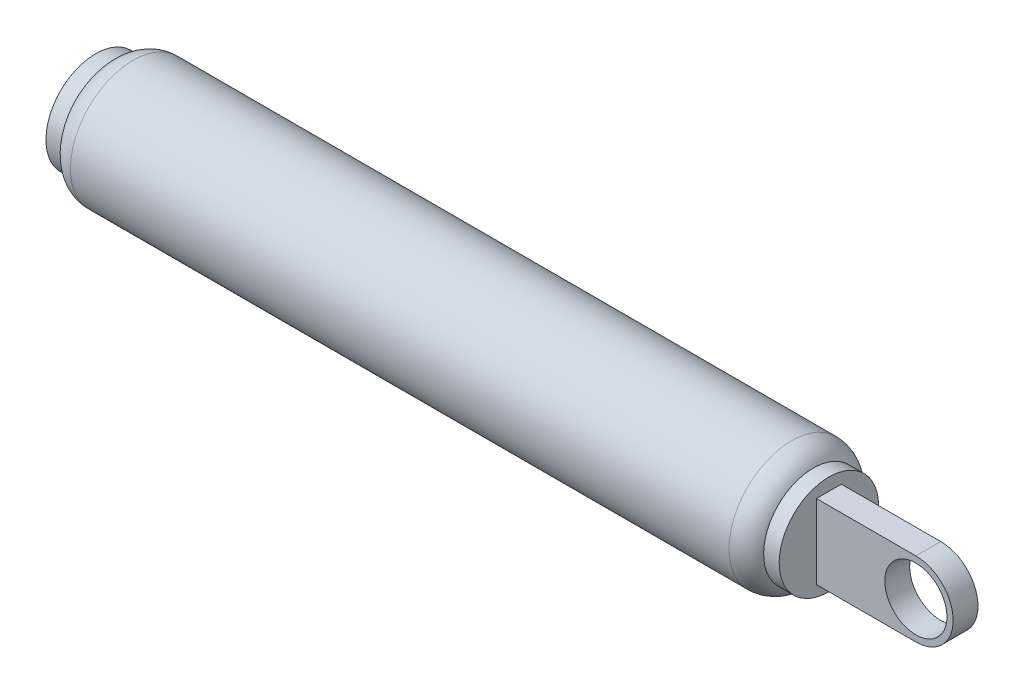
ISO-10303-21;
HEADER;
FILE_DESCRIPTION(('STEP AP214'),'2;1');
FILE_NAME('part.step','',(''),(''),'','','');
FILE_SCHEMA(('AUTOMOTIVE_DESIGN { 1 0 10303 214 1 1 1 1 }'));
ENDSEC;
DATA;
#1=APPLICATION_CONTEXT('core data for automotive mechanical design processes');
#2=APPLICATION_PROTOCOL_DEFINITION('international standard','automotive_design',2000,#1);
#3=PRODUCT_CONTEXT('',#1,'mechanical');
#4=PRODUCT('Part','Part','',(#3));
#5=PRODUCT_RELATED_PRODUCT_CATEGORY('part','',(#4));
#6=PRODUCT_DEFINITION_FORMATION('','',#4);
#7=PRODUCT_DEFINITION_CONTEXT('part definition',#1,'design');
#8=PRODUCT_DEFINITION('design','',#6,#7);
#9=PRODUCT_DEFINITION_SHAPE('','',#8);
#10=(LENGTH_UNIT() NAMED_UNIT(*) SI_UNIT(.MILLI.,.METRE.));
#11=(NAMED_UNIT(*) PLANE_ANGLE_UNIT() SI_UNIT($,.RADIAN.));
#12=(NAMED_UNIT(*) SI_UNIT($,.STERADIAN.) SOLID_ANGLE_UNIT());
#13=UNCERTAINTY_MEASURE_WITH_UNIT(LENGTH_MEASURE(1.E-05),#10,'distance_accuracy_value','');
#14=(GEOMETRIC_REPRESENTATION_CONTEXT(3) GLOBAL_UNCERTAINTY_ASSIGNED_CONTEXT((#13)) GLOBAL_UNIT_ASSIGNED_CONTEXT((#10,
#11,#12)) REPRESENTATION_CONTEXT('',''));
#15=CARTESIAN_POINT('',(0.,0.,0.));
#16=DIRECTION('',(0.,0.,1.));
#17=DIRECTION('',(1.,0.,0.));
#18=AXIS2_PLACEMENT_3D('',#15,#16,#17);
#19=CARTESIAN_POINT('',(29.5,0.,0.));
#20=DIRECTION('',(-1.,0.,0.));
#21=DIRECTION('',(0.,-1.,0.));
#22=AXIS2_PLACEMENT_3D('',#19,#20,#21);
#23=CYLINDRICAL_SURFACE('',#22,4.);
#24=CARTESIAN_POINT('',(29.5,0.,0.));
#25=DIRECTION('',(-1.,0.,0.));
#26=DIRECTION('',(0.,-1.,0.));
#27=AXIS2_PLACEMENT_3D('',#24,#25,#26);
#28=CIRCLE('',#27,4.);
#29=CARTESIAN_POINT('',(29.5,-4.,0.));
#30=VERTEX_POINT('',#29);
#31=EDGE_CURVE('E11',#30,#30,#28,.T.);
#32=ORIENTED_EDGE('',*,*,#31,.T.);
#33=EDGE_LOOP('',(#32));
#34=FACE_BOUND('',#33,.T.);
#35=CARTESIAN_POINT('',(28.25,0.,0.));
#36=DIRECTION('',(-1.,0.,0.));
#37=DIRECTION('',(0.,-1.,0.));
#38=AXIS2_PLACEMENT_3D('',#35,#36,#37);
#39=CIRCLE('',#38,4.);
#40=CARTESIAN_POINT('',(28.25,-4.,0.));
#41=VERTEX_POINT('',#40);
#42=EDGE_CURVE('E109',#41,#41,#39,.T.);
#43=ORIENTED_EDGE('',*,*,#42,.F.);
#44=EDGE_LOOP('',(#43));
#45=FACE_BOUND('',#44,.T.);
#46=ADVANCED_FACE('F39',(#34,#45),#23,.T.);
#47=CARTESIAN_POINT('',(29.5,4.,0.));
#48=DIRECTION('',(1.,0.,0.));
#49=DIRECTION('',(0.,1.,0.));
#50=AXIS2_PLACEMENT_3D('',#47,#48,#49);
#51=PLANE('',#50);
#52=DIRECTION('',(0.,-1.,0.));
#53=VECTOR('',#52,1.);
#54=CARTESIAN_POINT('',(29.5,3.,1.));
#55=LINE('',#54,#53);
#56=CARTESIAN_POINT('',(29.5,3.,1.));
#57=VERTEX_POINT('',#56);
#58=CARTESIAN_POINT('',(29.5,-3.,1.));
#59=VERTEX_POINT('',#58);
#60=EDGE_CURVE('E102',#57,#59,#55,.T.);
#61=ORIENTED_EDGE('',*,*,#60,.F.);
#62=DIRECTION('',(0.,0.,1.));
#63=VECTOR('',#62,1.);
#64=CARTESIAN_POINT('',(29.5,3.,-1.));
#65=LINE('',#64,#63);
#66=CARTESIAN_POINT('',(29.5,3.,-1.));
#67=VERTEX_POINT('',#66);
#68=EDGE_CURVE('E95',#67,#57,#65,.T.);
#69=ORIENTED_EDGE('',*,*,#68,.F.);
#70=DIRECTION('',(0.,-1.,0.));
#71=VECTOR('',#70,1.);
#72=CARTESIAN_POINT('',(29.5,3.,-1.));
#73=LINE('',#72,#71);
#74=CARTESIAN_POINT('',(29.5,-3.,-1.));
#75=VERTEX_POINT('',#74);
#76=EDGE_CURVE('E86',#67,#75,#73,.T.);
#77=ORIENTED_EDGE('',*,*,#76,.T.);
#78=DIRECTION('',(0.,0.,1.));
#79=VECTOR('',#78,1.);
#80=CARTESIAN_POINT('',(29.5,-3.,-1.));
#81=LINE('',#80,#79);
#82=EDGE_CURVE('E103',#75,#59,#81,.T.);
#83=ORIENTED_EDGE('',*,*,#82,.T.);
#84=EDGE_LOOP('',(#61,#69,#77,#83));
#85=FACE_BOUND('',#84,.T.);
#86=ORIENTED_EDGE('',*,*,#31,.F.);
#87=EDGE_LOOP('',(#86));
#88=FACE_BOUND('',#87,.T.);
#89=ADVANCED_FACE('F100',(#85,#88),#51,.T.);
#90=CARTESIAN_POINT('',(-29.5,0.,0.));
#91=DIRECTION('',(-1.,0.,0.));
#92=DIRECTION('',(0.,-1.,0.));
#93=AXIS2_PLACEMENT_3D('',#90,#91,#92);
#94=PLANE('',#93);
#95=CARTESIAN_POINT('',(-29.5,0.,0.));
#96=DIRECTION('',(-1.,0.,0.));
#97=DIRECTION('',(0.,0.,1.));
#98=AXIS2_PLACEMENT_3D('',#95,#96,#97);
#99=CIRCLE('',#98,2.99999999999999);
#100=CARTESIAN_POINT('',(-29.5,0.,2.99999999999999));
#101=VERTEX_POINT('',#100);
#102=EDGE_CURVE('E199',#101,#101,#99,.T.);
#103=ORIENTED_EDGE('',*,*,#102,.F.);
#104=EDGE_LOOP('',(#103));
#105=FACE_BOUND('',#104,.T.);
#106=CARTESIAN_POINT('',(-29.5,0.,0.));
#107=DIRECTION('',(-1.,0.,0.));
#108=DIRECTION('',(0.,-1.,0.));
#109=AXIS2_PLACEMENT_3D('',#106,#107,#108);
#110=CIRCLE('',#109,4.);
#111=CARTESIAN_POINT('',(-29.5,-3.99999999999999,0.));
#112=VERTEX_POINT('',#111);
#113=EDGE_CURVE('E46',#112,#112,#110,.T.);
#114=ORIENTED_EDGE('',*,*,#113,.T.);
#115=EDGE_LOOP('',(#114));
#116=FACE_BOUND('',#115,.T.);
#117=ADVANCED_FACE('F123',(#105,#116),#94,.T.);
#118=CARTESIAN_POINT('',(29.5,0.,0.));
#119=DIRECTION('',(-1.,0.,0.));
#120=DIRECTION('',(0.,-1.,0.));
#121=AXIS2_PLACEMENT_3D('',#118,#119,#120);
#122=CYLINDRICAL_SURFACE('',#121,4.);
#123=CARTESIAN_POINT('',(-28.25,0.,0.));
#124=DIRECTION('',(-1.,0.,0.));
#125=DIRECTION('',(0.,-1.,0.));
#126=AXIS2_PLACEMENT_3D('',#123,#124,#125);
#127=CIRCLE('',#126,4.);
#128=CARTESIAN_POINT('',(-28.25,-3.99999999999999,0.));
#129=VERTEX_POINT('',#128);
#130=EDGE_CURVE('E118',#129,#129,#127,.T.);
#131=ORIENTED_EDGE('',*,*,#130,.T.);
#132=EDGE_LOOP('',(#131));
#133=FACE_BOUND('',#132,.T.);
#134=ORIENTED_EDGE('',*,*,#113,.F.);
#135=EDGE_LOOP('',(#134));
#136=FACE_BOUND('',#135,.T.);
#137=ADVANCED_FACE('F125',(#133,#136),#122,.T.);
#138=CARTESIAN_POINT('',(-26.5,0.,0.));
#139=DIRECTION('',(-1.,0.,0.));
#140=DIRECTION('',(0.,-1.,0.));
#141=AXIS2_PLACEMENT_3D('',#138,#139,#140);
#142=TOROIDAL_SURFACE('',#141,3.03175416344815,2.);
#143=CARTESIAN_POINT('',(-26.5,0.,0.));
#144=DIRECTION('',(-1.,0.,0.));
#145=DIRECTION('',(0.,-1.,0.));
#146=AXIS2_PLACEMENT_3D('',#143,#144,#145);
#147=CIRCLE('',#146,5.03175416344814);
#148=CARTESIAN_POINT('',(-26.5,-5.03175416344813,0.));
#149=VERTEX_POINT('',#148);
#150=EDGE_CURVE('E115',#149,#149,#147,.T.);
#151=ORIENTED_EDGE('',*,*,#150,.T.);
#152=EDGE_LOOP('',(#151));
#153=FACE_BOUND('',#152,.T.);
#154=ORIENTED_EDGE('',*,*,#130,.F.);
#155=EDGE_LOOP('',(#154));
#156=FACE_BOUND('',#155,.T.);
#157=ADVANCED_FACE('F127',(#153,#156),#142,.T.);
#158=CARTESIAN_POINT('',(29.5,0.,0.));
#159=DIRECTION('',(-1.,0.,0.));
#160=DIRECTION('',(0.,-1.,0.));
#161=AXIS2_PLACEMENT_3D('',#158,#159,#160);
#162=CYLINDRICAL_SURFACE('',#161,5.03175416344814);
#163=CARTESIAN_POINT('',(26.5,0.,0.));
#164=DIRECTION('',(-1.,0.,0.));
#165=DIRECTION('',(0.,-1.,0.));
#166=AXIS2_PLACEMENT_3D('',#163,#164,#165);
#167=CIRCLE('',#166,5.03175416344814);
#168=CARTESIAN_POINT('',(26.5,-5.03175416344814,0.));
#169=VERTEX_POINT('',#168);
#170=EDGE_CURVE('E112',#169,#169,#167,.T.);
#171=ORIENTED_EDGE('',*,*,#170,.T.);
#172=EDGE_LOOP('',(#171));
#173=FACE_BOUND('',#172,.T.);
#174=ORIENTED_EDGE('',*,*,#150,.F.);
#175=EDGE_LOOP('',(#174));
#176=FACE_BOUND('',#175,.T.);
#177=ADVANCED_FACE('F134',(#173,#176),#162,.T.);
#178=CARTESIAN_POINT('',(26.5,0.,0.));
#179=DIRECTION('',(-1.,0.,0.));
#180=DIRECTION('',(0.,-1.,0.));
#181=AXIS2_PLACEMENT_3D('',#178,#179,#180);
#182=TOROIDAL_SURFACE('',#181,3.03175416344815,2.);
#183=ORIENTED_EDGE('',*,*,#42,.T.);
#184=EDGE_LOOP('',(#183));
#185=FACE_BOUND('',#184,.T.);
#186=ORIENTED_EDGE('',*,*,#170,.F.);
#187=EDGE_LOOP('',(#186));
#188=FACE_BOUND('',#187,.T.);
#189=ADVANCED_FACE('F148',(#185,#188),#182,.T.);
#190=CARTESIAN_POINT('',(37.5,0.,-1.));
#191=DIRECTION('',(0.,0.,1.));
#192=DIRECTION('',(1.,0.,0.));
#193=AXIS2_PLACEMENT_3D('',#190,#191,#192);
#194=CYLINDRICAL_SURFACE('',#193,3.);
#195=CARTESIAN_POINT('',(37.5,0.,1.));
#196=DIRECTION('',(0.,0.,1.));
#197=DIRECTION('',(1.,0.,0.));
#198=AXIS2_PLACEMENT_3D('',#195,#196,#197);
#199=CIRCLE('',#198,3.);
#200=CARTESIAN_POINT('',(37.5,-3.,1.));
#201=VERTEX_POINT('',#200);
#202=CARTESIAN_POINT('',(37.5,3.,1.));
#203=VERTEX_POINT('',#202);
#204=EDGE_CURVE('E207',#201,#203,#199,.T.);
#205=ORIENTED_EDGE('',*,*,#204,.F.);
#206=DIRECTION('',(0.,0.,1.));
#207=VECTOR('',#206,1.);
#208=CARTESIAN_POINT('',(37.5,-3.,-1.));
#209=LINE('',#208,#207);
#210=CARTESIAN_POINT('',(37.5,-3.,-1.));
#211=VERTEX_POINT('',#210);
#212=EDGE_CURVE('E61',#211,#201,#209,.T.);
#213=ORIENTED_EDGE('',*,*,#212,.F.);
#214=CARTESIAN_POINT('',(37.5,0.,-1.));
#215=DIRECTION('',(0.,0.,1.));
#216=DIRECTION('',(1.,0.,0.));
#217=AXIS2_PLACEMENT_3D('',#214,#215,#216);
#218=CIRCLE('',#217,3.);
#219=CARTESIAN_POINT('',(37.5,3.,-1.));
#220=VERTEX_POINT('',#219);
#221=EDGE_CURVE('E97',#211,#220,#218,.T.);
#222=ORIENTED_EDGE('',*,*,#221,.T.);
#223=DIRECTION('',(0.,0.,1.));
#224=VECTOR('',#223,1.);
#225=CARTESIAN_POINT('',(37.5,3.,-1.));
#226=LINE('',#225,#224);
#227=EDGE_CURVE('E80',#220,#203,#226,.T.);
#228=ORIENTED_EDGE('',*,*,#227,.T.);
#229=EDGE_LOOP('',(#205,#213,#222,#228));
#230=FACE_BOUND('',#229,.T.);
#231=ADVANCED_FACE('F151',(#230),#194,.T.);
#232=CARTESIAN_POINT('',(29.5,-3.,-1.));
#233=DIRECTION('',(0.,-1.,0.));
#234=DIRECTION('',(1.,0.,0.));
#235=AXIS2_PLACEMENT_3D('',#232,#233,#234);
#236=PLANE('',#235);
#237=DIRECTION('',(1.,0.,0.));
#238=VECTOR('',#237,1.);
#239=CARTESIAN_POINT('',(29.5,-3.,1.));
#240=LINE('',#239,#238);
#241=EDGE_CURVE('E53',#59,#201,#240,.T.);
#242=ORIENTED_EDGE('',*,*,#241,.F.);
#243=ORIENTED_EDGE('',*,*,#82,.F.);
#244=DIRECTION('',(1.,0.,0.));
#245=VECTOR('',#244,1.);
#246=CARTESIAN_POINT('',(29.5,-3.,-1.));
#247=LINE('',#246,#245);
#248=EDGE_CURVE('E89',#75,#211,#247,.T.);
#249=ORIENTED_EDGE('',*,*,#248,.T.);
#250=ORIENTED_EDGE('',*,*,#212,.T.);
#251=EDGE_LOOP('',(#242,#243,#249,#250));
#252=FACE_BOUND('',#251,.T.);
#253=ADVANCED_FACE('F166',(#252),#236,.T.);
#254=CARTESIAN_POINT('',(37.5,3.,-1.));
#255=DIRECTION('',(0.,1.,0.));
#256=DIRECTION('',(-1.,0.,0.));
#257=AXIS2_PLACEMENT_3D('',#254,#255,#256);
#258=PLANE('',#257);
#259=DIRECTION('',(-1.,0.,0.));
#260=VECTOR('',#259,1.);
#261=CARTESIAN_POINT('',(37.5,3.,1.));
#262=LINE('',#261,#260);
#263=EDGE_CURVE('E212',#203,#57,#262,.T.);
#264=ORIENTED_EDGE('',*,*,#263,.F.);
#265=ORIENTED_EDGE('',*,*,#227,.F.);
#266=DIRECTION('',(-1.,0.,0.));
#267=VECTOR('',#266,1.);
#268=CARTESIAN_POINT('',(37.5,3.,-1.));
#269=LINE('',#268,#267);
#270=EDGE_CURVE('E88',#220,#67,#269,.T.);
#271=ORIENTED_EDGE('',*,*,#270,.T.);
#272=ORIENTED_EDGE('',*,*,#68,.T.);
#273=EDGE_LOOP('',(#264,#265,#271,#272));
#274=FACE_BOUND('',#273,.T.);
#275=ADVANCED_FACE('F94',(#274),#258,.T.);
#276=CARTESIAN_POINT('',(37.5,0.,-1.));
#277=DIRECTION('',(0.,0.,1.));
#278=DIRECTION('',(1.,0.,0.));
#279=AXIS2_PLACEMENT_3D('',#276,#277,#278);
#280=PLANE('',#279);
#281=CARTESIAN_POINT('',(37.5,0.,-1.));
#282=DIRECTION('',(0.,0.,-1.));
#283=DIRECTION('',(-1.,0.,0.));
#284=AXIS2_PLACEMENT_3D('',#281,#282,#283);
#285=CIRCLE('',#284,2.49999999999999);
#286=CARTESIAN_POINT('',(35.,0.,-1.));
#287=VERTEX_POINT('',#286);
#288=EDGE_CURVE('E197',#287,#287,#285,.T.);
#289=ORIENTED_EDGE('',*,*,#288,.F.);
#290=EDGE_LOOP('',(#289));
#291=FACE_BOUND('',#290,.T.);
#292=ORIENTED_EDGE('',*,*,#221,.F.);
#293=ORIENTED_EDGE('',*,*,#248,.F.);
#294=ORIENTED_EDGE('',*,*,#76,.F.);
#295=ORIENTED_EDGE('',*,*,#270,.F.);
#296=EDGE_LOOP('',(#292,#293,#294,#295));
#297=FACE_BOUND('',#296,.T.);
#298=ADVANCED_FACE('F87',(#291,#297),#280,.F.);
#299=CARTESIAN_POINT('',(37.5,0.,1.));
#300=DIRECTION('',(0.,0.,1.));
#301=DIRECTION('',(1.,0.,0.));
#302=AXIS2_PLACEMENT_3D('',#299,#300,#301);
#303=PLANE('',#302);
#304=CARTESIAN_POINT('',(37.5,0.,1.));
#305=DIRECTION('',(0.,0.,1.));
#306=DIRECTION('',(1.,0.,0.));
#307=AXIS2_PLACEMENT_3D('',#304,#305,#306);
#308=CIRCLE('',#307,2.49999999999999);
#309=CARTESIAN_POINT('',(40.,0.,1.));
#310=VERTEX_POINT('',#309);
#311=EDGE_CURVE('E194',#310,#310,#308,.T.);
#312=ORIENTED_EDGE('',*,*,#311,.F.);
#313=EDGE_LOOP('',(#312));
#314=FACE_BOUND('',#313,.T.);
#315=ORIENTED_EDGE('',*,*,#204,.T.);
#316=ORIENTED_EDGE('',*,*,#263,.T.);
#317=ORIENTED_EDGE('',*,*,#60,.T.);
#318=ORIENTED_EDGE('',*,*,#241,.T.);
#319=EDGE_LOOP('',(#315,#316,#317,#318));
#320=FACE_BOUND('',#319,.T.);
#321=ADVANCED_FACE('F171',(#314,#320),#303,.T.);
#322=CARTESIAN_POINT('',(0.499999999999995,0.,0.));
#323=DIRECTION('',(1.,0.,0.));
#324=DIRECTION('',(0.,0.,-1.));
#325=AXIS2_PLACEMENT_3D('',#322,#323,#324);
#326=PLANE('',#325);
#327=CARTESIAN_POINT('',(0.5,0.,0.));
#328=DIRECTION('',(-1.,0.,0.));
#329=DIRECTION('',(0.,0.,1.));
#330=AXIS2_PLACEMENT_3D('',#327,#328,#329);
#331=CIRCLE('',#330,2.99999999999999);
#332=CARTESIAN_POINT('',(0.5,0.,2.99999999999999));
#333=VERTEX_POINT('',#332);
#334=EDGE_CURVE('E204',#333,#333,#331,.T.);
#335=ORIENTED_EDGE('',*,*,#334,.T.);
#336=EDGE_LOOP('',(#335));
#337=FACE_BOUND('',#336,.T.);
#338=ADVANCED_FACE('F174',(#337),#326,.F.);
#339=CARTESIAN_POINT('',(-29.5,0.,0.));
#340=DIRECTION('',(-1.,0.,0.));
#341=DIRECTION('',(0.,0.,1.));
#342=AXIS2_PLACEMENT_3D('',#339,#340,#341);
#343=CYLINDRICAL_SURFACE('',#342,2.99999999999999);
#344=ORIENTED_EDGE('',*,*,#334,.F.);
#345=EDGE_LOOP('',(#344));
#346=FACE_BOUND('',#345,.T.);
#347=ORIENTED_EDGE('',*,*,#102,.T.);
#348=EDGE_LOOP('',(#347));
#349=FACE_BOUND('',#348,.T.);
#350=ADVANCED_FACE('F181',(#346,#349),#343,.F.);
#351=CARTESIAN_POINT('',(37.5,0.,-1.));
#352=DIRECTION('',(0.,0.,-1.));
#353=DIRECTION('',(-1.,0.,0.));
#354=AXIS2_PLACEMENT_3D('',#351,#352,#353);
#355=CYLINDRICAL_SURFACE('',#354,2.49999999999999);
#356=ORIENTED_EDGE('',*,*,#311,.T.);
#357=EDGE_LOOP('',(#356));
#358=FACE_BOUND('',#357,.T.);
#359=ORIENTED_EDGE('',*,*,#288,.T.);
#360=EDGE_LOOP('',(#359));
#361=FACE_BOUND('',#360,.T.);
#362=ADVANCED_FACE('F185',(#358,#361),#355,.F.);
#363=CLOSED_SHELL('',(#46,#89,#117,#137,#157,#177,#189,#231,#253,#275,#298,#321,#338,#350,#362));
#364=MANIFOLD_SOLID_BREP('B2',#363);
#365=ADVANCED_BREP_SHAPE_REPRESENTATION('',(#18,#364),#14);
#366=SHAPE_DEFINITION_REPRESENTATION(#9,#365);
ENDSEC;
END-ISO-10303-21;
